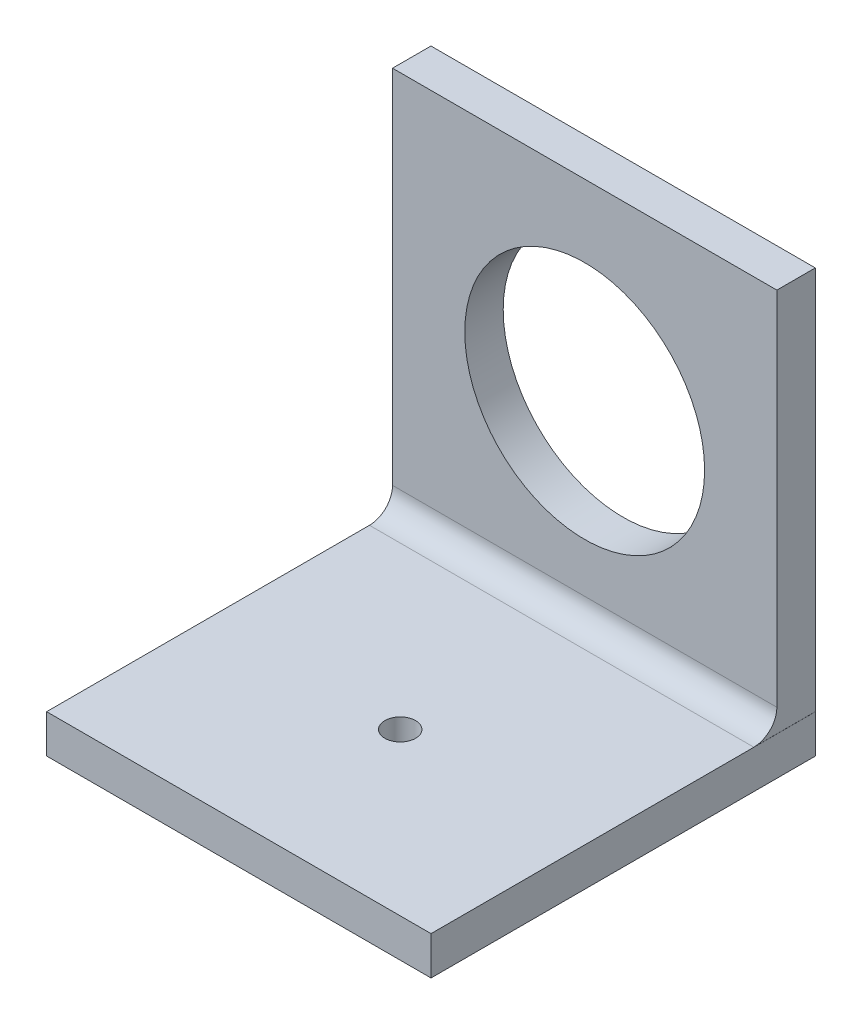
ISO-10303-21;
HEADER;
FILE_DESCRIPTION(('STEP AP214'),'2;1');
FILE_NAME('part.step','',(''),(''),'','','');
FILE_SCHEMA(('AUTOMOTIVE_DESIGN { 1 0 10303 214 1 1 1 1 }'));
ENDSEC;
DATA;
#1=APPLICATION_CONTEXT('core data for automotive mechanical design processes');
#2=APPLICATION_PROTOCOL_DEFINITION('international standard','automotive_design',2000,#1);
#3=PRODUCT_CONTEXT('',#1,'mechanical');
#4=PRODUCT('Part','Part','',(#3));
#5=PRODUCT_RELATED_PRODUCT_CATEGORY('part','',(#4));
#6=PRODUCT_DEFINITION_FORMATION('','',#4);
#7=PRODUCT_DEFINITION_CONTEXT('part definition',#1,'design');
#8=PRODUCT_DEFINITION('design','',#6,#7);
#9=PRODUCT_DEFINITION_SHAPE('','',#8);
#10=(LENGTH_UNIT() NAMED_UNIT(*) SI_UNIT(.MILLI.,.METRE.));
#11=(NAMED_UNIT(*) PLANE_ANGLE_UNIT() SI_UNIT($,.RADIAN.));
#12=(NAMED_UNIT(*) SI_UNIT($,.STERADIAN.) SOLID_ANGLE_UNIT());
#13=UNCERTAINTY_MEASURE_WITH_UNIT(LENGTH_MEASURE(1.E-05),#10,'distance_accuracy_value','');
#14=(GEOMETRIC_REPRESENTATION_CONTEXT(3) GLOBAL_UNCERTAINTY_ASSIGNED_CONTEXT((#13)) GLOBAL_UNIT_ASSIGNED_CONTEXT((#10,
#11,#12)) REPRESENTATION_CONTEXT('',''));
#15=CARTESIAN_POINT('',(0.,0.,0.));
#16=DIRECTION('',(0.,0.,1.));
#17=DIRECTION('',(1.,0.,0.));
#18=AXIS2_PLACEMENT_3D('',#15,#16,#17);
#19=CARTESIAN_POINT('',(0.,0.,5.));
#20=DIRECTION('',(1.,0.,0.));
#21=DIRECTION('',(0.,1.,0.));
#22=AXIS2_PLACEMENT_3D('',#19,#20,#21);
#23=PLANE('',#22);
#24=DIRECTION('',(0.,-1.,0.));
#25=VECTOR('',#24,1.);
#26=CARTESIAN_POINT('',(0.,0.,0.));
#27=LINE('',#26,#25);
#28=CARTESIAN_POINT('',(0.,50.,0.));
#29=VERTEX_POINT('',#28);
#30=CARTESIAN_POINT('',(0.,-5.,0.));
#31=VERTEX_POINT('',#30);
#32=EDGE_CURVE('E118',#29,#31,#27,.T.);
#33=ORIENTED_EDGE('',*,*,#32,.T.);
#34=DIRECTION('',(0.,0.,-1.));
#35=VECTOR('',#34,1.);
#36=CARTESIAN_POINT('',(0.,-5.,50.));
#37=LINE('',#36,#35);
#38=CARTESIAN_POINT('',(0.,-5.,50.));
#39=VERTEX_POINT('',#38);
#40=EDGE_CURVE('E101',#39,#31,#37,.T.);
#41=ORIENTED_EDGE('',*,*,#40,.F.);
#42=DIRECTION('',(0.,-1.,0.));
#43=VECTOR('',#42,1.);
#44=CARTESIAN_POINT('',(0.,0.,50.));
#45=LINE('',#44,#43);
#46=CARTESIAN_POINT('',(0.,0.,50.));
#47=VERTEX_POINT('',#46);
#48=EDGE_CURVE('E107',#47,#39,#45,.T.);
#49=ORIENTED_EDGE('',*,*,#48,.F.);
#50=DIRECTION('',(0.,0.,-1.));
#51=VECTOR('',#50,1.);
#52=CARTESIAN_POINT('',(0.,0.,50.));
#53=LINE('',#52,#51);
#54=CARTESIAN_POINT('',(0.,0.,8.));
#55=VERTEX_POINT('',#54);
#56=EDGE_CURVE('E132',#47,#55,#53,.T.);
#57=ORIENTED_EDGE('',*,*,#56,.T.);
#58=CARTESIAN_POINT('',(0.,3.,8.));
#59=DIRECTION('',(1.,0.,0.));
#60=DIRECTION('',(0.,1.,0.));
#61=AXIS2_PLACEMENT_3D('',#58,#59,#60);
#62=CIRCLE('',#61,3.);
#63=CARTESIAN_POINT('',(0.,3.,5.));
#64=VERTEX_POINT('',#63);
#65=EDGE_CURVE('E11',#55,#64,#62,.T.);
#66=ORIENTED_EDGE('',*,*,#65,.T.);
#67=DIRECTION('',(0.,-1.,0.));
#68=VECTOR('',#67,1.);
#69=CARTESIAN_POINT('',(0.,0.,5.));
#70=LINE('',#69,#68);
#71=CARTESIAN_POINT('',(0.,50.,5.));
#72=VERTEX_POINT('',#71);
#73=EDGE_CURVE('E261',#72,#64,#70,.T.);
#74=ORIENTED_EDGE('',*,*,#73,.F.);
#75=DIRECTION('',(0.,0.,-1.));
#76=VECTOR('',#75,1.);
#77=CARTESIAN_POINT('',(0.,50.,5.));
#78=LINE('',#77,#76);
#79=EDGE_CURVE('E284',#72,#29,#78,.T.);
#80=ORIENTED_EDGE('',*,*,#79,.T.);
#81=EDGE_LOOP('',(#33,#41,#49,#57,#66,#74,#80));
#82=FACE_BOUND('',#81,.T.);
#83=ADVANCED_FACE('F33',(#82),#23,.F.);
#84=CARTESIAN_POINT('',(50.,0.,5.));
#85=DIRECTION('',(-1.,0.,0.));
#86=DIRECTION('',(0.,-1.,0.));
#87=AXIS2_PLACEMENT_3D('',#84,#85,#86);
#88=PLANE('',#87);
#89=DIRECTION('',(0.,1.,0.));
#90=VECTOR('',#89,1.);
#91=CARTESIAN_POINT('',(50.,0.,0.));
#92=LINE('',#91,#90);
#93=CARTESIAN_POINT('',(50.,0.,0.));
#94=VERTEX_POINT('',#93);
#95=CARTESIAN_POINT('',(50.,50.,0.));
#96=VERTEX_POINT('',#95);
#97=EDGE_CURVE('E271',#94,#96,#92,.T.);
#98=ORIENTED_EDGE('',*,*,#97,.T.);
#99=DIRECTION('',(0.,0.,-1.));
#100=VECTOR('',#99,1.);
#101=CARTESIAN_POINT('',(50.,50.,5.));
#102=LINE('',#101,#100);
#103=CARTESIAN_POINT('',(50.,50.,5.));
#104=VERTEX_POINT('',#103);
#105=EDGE_CURVE('E278',#104,#96,#102,.T.);
#106=ORIENTED_EDGE('',*,*,#105,.F.);
#107=DIRECTION('',(0.,1.,0.));
#108=VECTOR('',#107,1.);
#109=CARTESIAN_POINT('',(50.,0.,5.));
#110=LINE('',#109,#108);
#111=CARTESIAN_POINT('',(50.,3.,5.));
#112=VERTEX_POINT('',#111);
#113=EDGE_CURVE('E267',#112,#104,#110,.T.);
#114=ORIENTED_EDGE('',*,*,#113,.F.);
#115=CARTESIAN_POINT('',(50.,3.,8.));
#116=DIRECTION('',(-1.,0.,0.));
#117=DIRECTION('',(0.,-1.,0.));
#118=AXIS2_PLACEMENT_3D('',#115,#116,#117);
#119=CIRCLE('',#118,3.);
#120=CARTESIAN_POINT('',(50.,0.,8.));
#121=VERTEX_POINT('',#120);
#122=EDGE_CURVE('E41',#112,#121,#119,.T.);
#123=ORIENTED_EDGE('',*,*,#122,.T.);
#124=DIRECTION('',(0.,0.,-1.));
#125=VECTOR('',#124,1.);
#126=CARTESIAN_POINT('',(50.,0.,5.));
#127=LINE('',#126,#125);
#128=EDGE_CURVE('E48',#121,#94,#127,.T.);
#129=ORIENTED_EDGE('',*,*,#128,.T.);
#130=EDGE_LOOP('',(#98,#106,#114,#123,#129));
#131=FACE_BOUND('',#130,.T.);
#132=ADVANCED_FACE('F171',(#131),#88,.F.);
#133=CARTESIAN_POINT('',(0.,50.,5.));
#134=DIRECTION('',(0.,-1.,0.));
#135=DIRECTION('',(0.,0.,-1.));
#136=AXIS2_PLACEMENT_3D('',#133,#134,#135);
#137=PLANE('',#136);
#138=DIRECTION('',(-1.,0.,0.));
#139=VECTOR('',#138,1.);
#140=CARTESIAN_POINT('',(0.,50.,0.));
#141=LINE('',#140,#139);
#142=EDGE_CURVE('E268',#96,#29,#141,.T.);
#143=ORIENTED_EDGE('',*,*,#142,.T.);
#144=ORIENTED_EDGE('',*,*,#79,.F.);
#145=DIRECTION('',(-1.,0.,0.));
#146=VECTOR('',#145,1.);
#147=CARTESIAN_POINT('',(0.,50.,5.));
#148=LINE('',#147,#146);
#149=EDGE_CURVE('E265',#104,#72,#148,.T.);
#150=ORIENTED_EDGE('',*,*,#149,.F.);
#151=ORIENTED_EDGE('',*,*,#105,.T.);
#152=EDGE_LOOP('',(#143,#144,#150,#151));
#153=FACE_BOUND('',#152,.T.);
#154=ADVANCED_FACE('F175',(#153),#137,.F.);
#155=CARTESIAN_POINT('',(0.,0.,5.));
#156=DIRECTION('',(0.,0.,-1.));
#157=DIRECTION('',(-1.,0.,0.));
#158=AXIS2_PLACEMENT_3D('',#155,#156,#157);
#159=PLANE('',#158);
#160=CARTESIAN_POINT('',(25.,25.,5.));
#161=DIRECTION('',(0.,0.,-1.));
#162=DIRECTION('',(-1.,0.,0.));
#163=AXIS2_PLACEMENT_3D('',#160,#161,#162);
#164=CIRCLE('',#163,15.6);
#165=CARTESIAN_POINT('',(9.39999999999999,25.,5.));
#166=VERTEX_POINT('',#165);
#167=EDGE_CURVE('E123',#166,#166,#164,.T.);
#168=ORIENTED_EDGE('',*,*,#167,.T.);
#169=EDGE_LOOP('',(#168));
#170=FACE_BOUND('',#169,.T.);
#171=ORIENTED_EDGE('',*,*,#73,.T.);
#172=DIRECTION('',(1.,0.,0.));
#173=VECTOR('',#172,1.);
#174=CARTESIAN_POINT('',(50.,3.,5.));
#175=LINE('',#174,#173);
#176=EDGE_CURVE('E258',#64,#112,#175,.T.);
#177=ORIENTED_EDGE('',*,*,#176,.T.);
#178=ORIENTED_EDGE('',*,*,#113,.T.);
#179=ORIENTED_EDGE('',*,*,#149,.T.);
#180=EDGE_LOOP('',(#171,#177,#178,#179));
#181=FACE_BOUND('',#180,.T.);
#182=ADVANCED_FACE('F181',(#170,#181),#159,.F.);
#183=CARTESIAN_POINT('',(0.,0.,0.));
#184=DIRECTION('',(0.,0.,-1.));
#185=DIRECTION('',(-1.,0.,0.));
#186=AXIS2_PLACEMENT_3D('',#183,#184,#185);
#187=PLANE('',#186);
#188=CARTESIAN_POINT('',(25.,25.,0.));
#189=DIRECTION('',(0.,0.,-1.));
#190=DIRECTION('',(-1.,0.,0.));
#191=AXIS2_PLACEMENT_3D('',#188,#189,#190);
#192=CIRCLE('',#191,15.6);
#193=CARTESIAN_POINT('',(9.39999999999999,25.,0.));
#194=VERTEX_POINT('',#193);
#195=EDGE_CURVE('E120',#194,#194,#192,.T.);
#196=ORIENTED_EDGE('',*,*,#195,.F.);
#197=EDGE_LOOP('',(#196));
#198=FACE_BOUND('',#197,.T.);
#199=ORIENTED_EDGE('',*,*,#32,.F.);
#200=ORIENTED_EDGE('',*,*,#142,.F.);
#201=ORIENTED_EDGE('',*,*,#97,.F.);
#202=DIRECTION('',(-1.,0.,0.));
#203=VECTOR('',#202,1.);
#204=CARTESIAN_POINT('',(0.,0.,0.));
#205=LINE('',#204,#203);
#206=CARTESIAN_POINT('',(50.0110248377446,0.,0.));
#207=VERTEX_POINT('',#206);
#208=EDGE_CURVE('E114',#207,#94,#205,.T.);
#209=ORIENTED_EDGE('',*,*,#208,.F.);
#210=DIRECTION('',(0.,1.,0.));
#211=VECTOR('',#210,1.);
#212=CARTESIAN_POINT('',(50.0110248377446,0.,0.));
#213=LINE('',#212,#211);
#214=CARTESIAN_POINT('',(50.0110248377446,-5.,0.));
#215=VERTEX_POINT('',#214);
#216=EDGE_CURVE('E131',#215,#207,#213,.T.);
#217=ORIENTED_EDGE('',*,*,#216,.F.);
#218=DIRECTION('',(1.,0.,0.));
#219=VECTOR('',#218,1.);
#220=CARTESIAN_POINT('',(0.,-5.,0.));
#221=LINE('',#220,#219);
#222=EDGE_CURVE('E145',#31,#215,#221,.T.);
#223=ORIENTED_EDGE('',*,*,#222,.F.);
#224=EDGE_LOOP('',(#199,#200,#201,#209,#217,#223));
#225=FACE_BOUND('',#224,.T.);
#226=ADVANCED_FACE('F183',(#198,#225),#187,.T.);
#227=CARTESIAN_POINT('',(25.,25.,-14.));
#228=DIRECTION('',(0.,0.,1.));
#229=DIRECTION('',(1.,0.,0.));
#230=AXIS2_PLACEMENT_3D('',#227,#228,#229);
#231=CYLINDRICAL_SURFACE('',#230,15.6);
#232=ORIENTED_EDGE('',*,*,#195,.T.);
#233=EDGE_LOOP('',(#232));
#234=FACE_BOUND('',#233,.T.);
#235=ORIENTED_EDGE('',*,*,#167,.F.);
#236=EDGE_LOOP('',(#235));
#237=FACE_BOUND('',#236,.T.);
#238=ADVANCED_FACE('F186',(#234,#237),#231,.F.);
#239=CARTESIAN_POINT('',(0.,-5.,50.));
#240=DIRECTION('',(0.,1.,0.));
#241=DIRECTION('',(0.,0.,1.));
#242=AXIS2_PLACEMENT_3D('',#239,#240,#241);
#243=PLANE('',#242);
#244=CARTESIAN_POINT('',(25.0027562094362,-5.,29.));
#245=DIRECTION('',(0.,1.,0.));
#246=DIRECTION('',(0.,0.,1.));
#247=AXIS2_PLACEMENT_3D('',#244,#245,#246);
#248=CIRCLE('',#247,2.);
#249=CARTESIAN_POINT('',(25.0027562094362,-5.,31.));
#250=VERTEX_POINT('',#249);
#251=EDGE_CURVE('E146',#250,#250,#248,.T.);
#252=ORIENTED_EDGE('',*,*,#251,.T.);
#253=EDGE_LOOP('',(#252));
#254=FACE_BOUND('',#253,.T.);
#255=ORIENTED_EDGE('',*,*,#222,.T.);
#256=DIRECTION('',(0.,0.,-1.));
#257=VECTOR('',#256,1.);
#258=CARTESIAN_POINT('',(50.0110248377446,-5.,50.));
#259=LINE('',#258,#257);
#260=CARTESIAN_POINT('',(50.0110248377446,-5.,50.));
#261=VERTEX_POINT('',#260);
#262=EDGE_CURVE('E103',#261,#215,#259,.T.);
#263=ORIENTED_EDGE('',*,*,#262,.F.);
#264=DIRECTION('',(1.,0.,0.));
#265=VECTOR('',#264,1.);
#266=CARTESIAN_POINT('',(0.,-5.,50.));
#267=LINE('',#266,#265);
#268=EDGE_CURVE('E97',#39,#261,#267,.T.);
#269=ORIENTED_EDGE('',*,*,#268,.F.);
#270=ORIENTED_EDGE('',*,*,#40,.T.);
#271=EDGE_LOOP('',(#255,#263,#269,#270));
#272=FACE_BOUND('',#271,.T.);
#273=ADVANCED_FACE('F99',(#254,#272),#243,.F.);
#274=CARTESIAN_POINT('',(50.0110248377446,0.,50.));
#275=DIRECTION('',(-1.,0.,0.));
#276=DIRECTION('',(0.,0.,1.));
#277=AXIS2_PLACEMENT_3D('',#274,#275,#276);
#278=PLANE('',#277);
#279=ORIENTED_EDGE('',*,*,#216,.T.);
#280=DIRECTION('',(0.,0.,-1.));
#281=VECTOR('',#280,1.);
#282=CARTESIAN_POINT('',(50.0110248377446,0.,50.));
#283=LINE('',#282,#281);
#284=CARTESIAN_POINT('',(50.0110248377446,0.,50.));
#285=VERTEX_POINT('',#284);
#286=EDGE_CURVE('E125',#285,#207,#283,.T.);
#287=ORIENTED_EDGE('',*,*,#286,.F.);
#288=DIRECTION('',(0.,1.,0.));
#289=VECTOR('',#288,1.);
#290=CARTESIAN_POINT('',(50.0110248377446,0.,50.));
#291=LINE('',#290,#289);
#292=EDGE_CURVE('E106',#261,#285,#291,.T.);
#293=ORIENTED_EDGE('',*,*,#292,.F.);
#294=ORIENTED_EDGE('',*,*,#262,.T.);
#295=EDGE_LOOP('',(#279,#287,#293,#294));
#296=FACE_BOUND('',#295,.T.);
#297=ADVANCED_FACE('F161',(#296),#278,.F.);
#298=CARTESIAN_POINT('',(0.,0.,50.));
#299=DIRECTION('',(0.,-1.,0.));
#300=DIRECTION('',(0.,0.,-1.));
#301=AXIS2_PLACEMENT_3D('',#298,#299,#300);
#302=PLANE('',#301);
#303=CARTESIAN_POINT('',(25.0027562094362,0.,29.));
#304=DIRECTION('',(0.,1.,0.));
#305=DIRECTION('',(0.,0.,1.));
#306=AXIS2_PLACEMENT_3D('',#303,#304,#305);
#307=CIRCLE('',#306,2.);
#308=CARTESIAN_POINT('',(25.0027562094362,0.,31.));
#309=VERTEX_POINT('',#308);
#310=EDGE_CURVE('E148',#309,#309,#307,.T.);
#311=ORIENTED_EDGE('',*,*,#310,.F.);
#312=EDGE_LOOP('',(#311));
#313=FACE_BOUND('',#312,.T.);
#314=ORIENTED_EDGE('',*,*,#128,.F.);
#315=DIRECTION('',(1.,0.,0.));
#316=VECTOR('',#315,1.);
#317=CARTESIAN_POINT('',(0.,0.,8.));
#318=LINE('',#317,#316);
#319=EDGE_CURVE('E53',#121,#55,#318,.F.);
#320=ORIENTED_EDGE('',*,*,#319,.T.);
#321=ORIENTED_EDGE('',*,*,#56,.F.);
#322=DIRECTION('',(-1.,0.,0.));
#323=VECTOR('',#322,1.);
#324=CARTESIAN_POINT('',(0.,0.,50.));
#325=LINE('',#324,#323);
#326=EDGE_CURVE('E112',#285,#47,#325,.T.);
#327=ORIENTED_EDGE('',*,*,#326,.F.);
#328=ORIENTED_EDGE('',*,*,#286,.T.);
#329=ORIENTED_EDGE('',*,*,#208,.T.);
#330=EDGE_LOOP('',(#314,#320,#321,#327,#328,#329));
#331=FACE_BOUND('',#330,.T.);
#332=ADVANCED_FACE('F159',(#313,#331),#302,.F.);
#333=CARTESIAN_POINT('',(0.,0.,50.));
#334=DIRECTION('',(0.,0.,1.));
#335=DIRECTION('',(1.,0.,0.));
#336=AXIS2_PLACEMENT_3D('',#333,#334,#335);
#337=PLANE('',#336);
#338=ORIENTED_EDGE('',*,*,#48,.T.);
#339=ORIENTED_EDGE('',*,*,#268,.T.);
#340=ORIENTED_EDGE('',*,*,#292,.T.);
#341=ORIENTED_EDGE('',*,*,#326,.T.);
#342=EDGE_LOOP('',(#338,#339,#340,#341));
#343=FACE_BOUND('',#342,.T.);
#344=ADVANCED_FACE('F110',(#343),#337,.T.);
#345=CARTESIAN_POINT('',(0.,3.,8.));
#346=DIRECTION('',(-1.,0.,0.));
#347=DIRECTION('',(0.,0.,1.));
#348=AXIS2_PLACEMENT_3D('',#345,#346,#347);
#349=CYLINDRICAL_SURFACE('',#348,3.);
#350=ORIENTED_EDGE('',*,*,#65,.F.);
#351=ORIENTED_EDGE('',*,*,#319,.F.);
#352=ORIENTED_EDGE('',*,*,#122,.F.);
#353=ORIENTED_EDGE('',*,*,#176,.F.);
#354=EDGE_LOOP('',(#350,#351,#352,#353));
#355=FACE_BOUND('',#354,.T.);
#356=ADVANCED_FACE('F35',(#355),#349,.F.);
#357=CARTESIAN_POINT('',(25.0027562094362,-14.,29.));
#358=DIRECTION('',(0.,1.,0.));
#359=DIRECTION('',(0.,0.,1.));
#360=AXIS2_PLACEMENT_3D('',#357,#358,#359);
#361=CYLINDRICAL_SURFACE('',#360,2.);
#362=ORIENTED_EDGE('',*,*,#310,.T.);
#363=EDGE_LOOP('',(#362));
#364=FACE_BOUND('',#363,.T.);
#365=ORIENTED_EDGE('',*,*,#251,.F.);
#366=EDGE_LOOP('',(#365));
#367=FACE_BOUND('',#366,.T.);
#368=ADVANCED_FACE('F156',(#364,#367),#361,.F.);
#369=CLOSED_SHELL('',(#83,#132,#154,#182,#226,#238,#273,#297,#332,#344,#356,#368));
#370=MANIFOLD_SOLID_BREP('B2',#369);
#371=ADVANCED_BREP_SHAPE_REPRESENTATION('',(#18,#370),#14);
#372=SHAPE_DEFINITION_REPRESENTATION(#9,#371);
ENDSEC;
END-ISO-10303-21;
